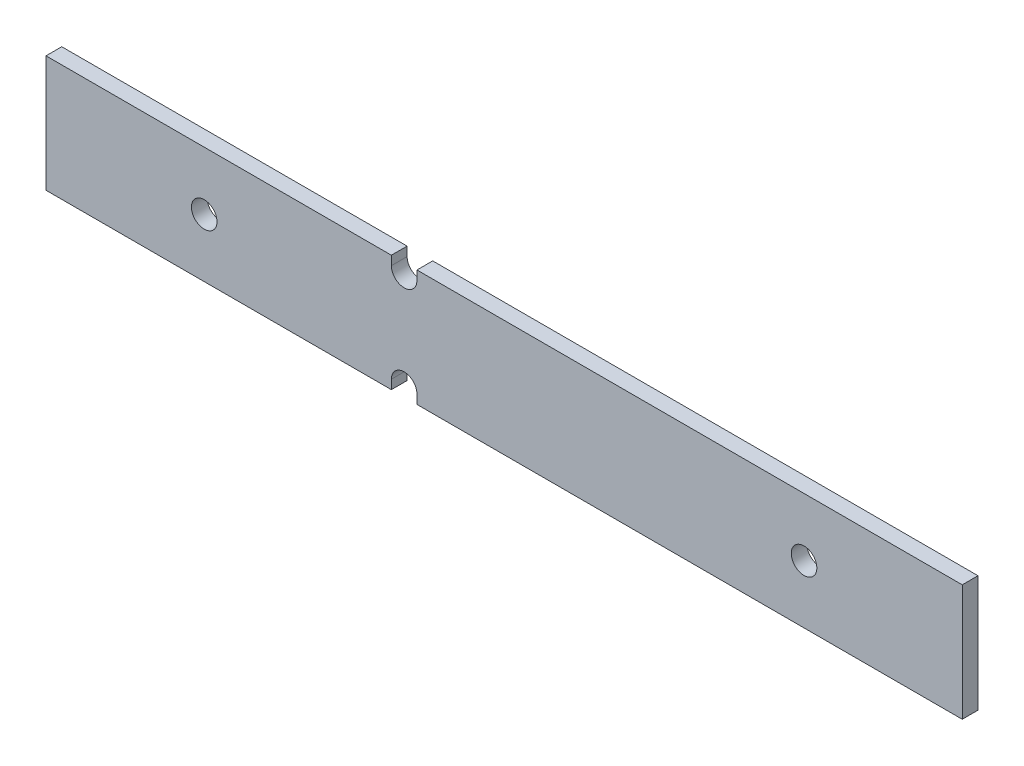
ISO-10303-21;
HEADER;
FILE_DESCRIPTION(('STEP AP214'),'2;1');
FILE_NAME('part.step','',(''),(''),'','','');
FILE_SCHEMA(('AUTOMOTIVE_DESIGN { 1 0 10303 214 1 1 1 1 }'));
ENDSEC;
DATA;
#1=APPLICATION_CONTEXT('core data for automotive mechanical design processes');
#2=APPLICATION_PROTOCOL_DEFINITION('international standard','automotive_design',2000,#1);
#3=PRODUCT_CONTEXT('',#1,'mechanical');
#4=PRODUCT('Part','Part','',(#3));
#5=PRODUCT_RELATED_PRODUCT_CATEGORY('part','',(#4));
#6=PRODUCT_DEFINITION_FORMATION('','',#4);
#7=PRODUCT_DEFINITION_CONTEXT('part definition',#1,'design');
#8=PRODUCT_DEFINITION('design','',#6,#7);
#9=PRODUCT_DEFINITION_SHAPE('','',#8);
#10=(LENGTH_UNIT() NAMED_UNIT(*) SI_UNIT(.MILLI.,.METRE.));
#11=(NAMED_UNIT(*) PLANE_ANGLE_UNIT() SI_UNIT($,.RADIAN.));
#12=(NAMED_UNIT(*) SI_UNIT($,.STERADIAN.) SOLID_ANGLE_UNIT());
#13=UNCERTAINTY_MEASURE_WITH_UNIT(LENGTH_MEASURE(1.E-05),#10,'distance_accuracy_value','');
#14=(GEOMETRIC_REPRESENTATION_CONTEXT(3) GLOBAL_UNCERTAINTY_ASSIGNED_CONTEXT((#13)) GLOBAL_UNIT_ASSIGNED_CONTEXT((#10,
#11,#12)) REPRESENTATION_CONTEXT('',''));
#15=CARTESIAN_POINT('',(0.,0.,0.));
#16=DIRECTION('',(0.,0.,1.));
#17=DIRECTION('',(1.,0.,0.));
#18=AXIS2_PLACEMENT_3D('',#15,#16,#17);
#19=CARTESIAN_POINT('',(-50.8000000637241,-4.99745883228669,3.23019999998743));
#20=DIRECTION('',(0.,0.,1.));
#21=DIRECTION('',(1.,0.,0.));
#22=AXIS2_PLACEMENT_3D('',#19,#20,#21);
#23=CYLINDRICAL_SURFACE('',#22,1.3);
#24=CARTESIAN_POINT('',(-50.8000000637241,-4.99745883228669,3.23019999998743));
#25=DIRECTION('',(0.,0.,1.));
#26=DIRECTION('',(1.,0.,0.));
#27=AXIS2_PLACEMENT_3D('',#24,#25,#26);
#28=CIRCLE('',#27,1.3);
#29=CARTESIAN_POINT('',(-49.5000000637241,-4.99745883228651,3.23019999998743));
#30=VERTEX_POINT('',#29);
#31=CARTESIAN_POINT('',(-52.1000000637241,-4.99745883228699,3.23019999998737));
#32=VERTEX_POINT('',#31);
#33=EDGE_CURVE('E178',#30,#32,#28,.T.);
#34=ORIENTED_EDGE('',*,*,#33,.T.);
#35=DIRECTION('',(0.,0.,1.));
#36=VECTOR('',#35,1.);
#37=CARTESIAN_POINT('',(-52.1000000637241,-4.997458832287,1.6299999999874));
#38=LINE('',#37,#36);
#39=CARTESIAN_POINT('',(-52.1000000637241,-4.997458832287,1.6299999999874));
#40=VERTEX_POINT('',#39);
#41=EDGE_CURVE('E221',#40,#32,#38,.T.);
#42=ORIENTED_EDGE('',*,*,#41,.F.);
#43=CARTESIAN_POINT('',(-50.8000000637241,-4.99745883228669,1.62999999998741));
#44=DIRECTION('',(0.,0.,1.));
#45=DIRECTION('',(1.,0.,0.));
#46=AXIS2_PLACEMENT_3D('',#43,#44,#45);
#47=CIRCLE('',#46,1.3);
#48=CARTESIAN_POINT('',(-49.5000000637241,-4.99745883228652,1.62999999998741));
#49=VERTEX_POINT('',#48);
#50=EDGE_CURVE('E49',#49,#40,#47,.T.);
#51=ORIENTED_EDGE('',*,*,#50,.F.);
#52=DIRECTION('',(0.,0.,1.));
#53=VECTOR('',#52,1.);
#54=CARTESIAN_POINT('',(-49.5000000637241,-4.99745883228652,1.62999999998741));
#55=LINE('',#54,#53);
#56=EDGE_CURVE('E245',#49,#30,#55,.T.);
#57=ORIENTED_EDGE('',*,*,#56,.T.);
#58=EDGE_LOOP('',(#34,#42,#51,#57));
#59=FACE_BOUND('',#58,.T.);
#60=ADVANCED_FACE('F41',(#59),#23,.F.);
#61=CARTESIAN_POINT('',(5.9181999539004,5.91819995396554,3.23019999998763));
#62=DIRECTION('',(0.,-1.,0.));
#63=DIRECTION('',(1.,0.,0.));
#64=AXIS2_PLACEMENT_3D('',#61,#62,#63);
#65=PLANE('',#64);
#66=DIRECTION('',(-1.,0.,0.));
#67=VECTOR('',#66,1.);
#68=CARTESIAN_POINT('',(5.9181999539004,5.91819995396554,1.62999999998762));
#69=LINE('',#68,#67);
#70=CARTESIAN_POINT('',(5.9181999539004,5.91819995396554,1.62999999998762));
#71=VERTEX_POINT('',#70);
#72=CARTESIAN_POINT('',(-49.5000000637242,5.91819995396584,1.62999999998741));
#73=VERTEX_POINT('',#72);
#74=EDGE_CURVE('E263',#71,#73,#69,.T.);
#75=ORIENTED_EDGE('',*,*,#74,.T.);
#76=DIRECTION('',(0.,0.,1.));
#77=VECTOR('',#76,1.);
#78=CARTESIAN_POINT('',(-49.5000000637242,5.91819995396584,1.62999999998741));
#79=LINE('',#78,#77);
#80=CARTESIAN_POINT('',(-49.5000000637242,5.91819995396584,3.23019999998742));
#81=VERTEX_POINT('',#80);
#82=EDGE_CURVE('E230',#73,#81,#79,.T.);
#83=ORIENTED_EDGE('',*,*,#82,.T.);
#84=DIRECTION('',(-1.,0.,0.));
#85=VECTOR('',#84,1.);
#86=CARTESIAN_POINT('',(5.9181999539004,5.91819995396554,3.23019999998763));
#87=LINE('',#86,#85);
#88=CARTESIAN_POINT('',(5.9181999539004,5.91819995396554,3.23019999998763));
#89=VERTEX_POINT('',#88);
#90=EDGE_CURVE('E209',#89,#81,#87,.T.);
#91=ORIENTED_EDGE('',*,*,#90,.F.);
#92=DIRECTION('',(0.,0.,-1.));
#93=VECTOR('',#92,1.);
#94=CARTESIAN_POINT('',(5.9181999539004,5.91819995396554,3.23019999998763));
#95=LINE('',#94,#93);
#96=EDGE_CURVE('E169',#89,#71,#95,.T.);
#97=ORIENTED_EDGE('',*,*,#96,.T.);
#98=EDGE_LOOP('',(#75,#83,#91,#97));
#99=FACE_BOUND('',#98,.T.);
#100=ADVANCED_FACE('F265',(#99),#65,.F.);
#101=CARTESIAN_POINT('',(5.91819995390036,-5.91819995397096,3.23019999998758));
#102=DIRECTION('',(0.,1.,0.));
#103=DIRECTION('',(-1.,0.,0.));
#104=AXIS2_PLACEMENT_3D('',#101,#102,#103);
#105=PLANE('',#104);
#106=DIRECTION('',(1.,0.,0.));
#107=VECTOR('',#106,1.);
#108=CARTESIAN_POINT('',(5.91819995390036,-5.91819995397096,1.62999999998764));
#109=LINE('',#108,#107);
#110=CARTESIAN_POINT('',(-87.1981999509101,-5.91819995397121,1.62999999998727));
#111=VERTEX_POINT('',#110);
#112=CARTESIAN_POINT('',(-52.1000000637242,-5.91819995397121,1.6299999999874));
#113=VERTEX_POINT('',#112);
#114=EDGE_CURVE('E144',#111,#113,#109,.T.);
#115=ORIENTED_EDGE('',*,*,#114,.T.);
#116=DIRECTION('',(0.,0.,1.));
#117=VECTOR('',#116,1.);
#118=CARTESIAN_POINT('',(-52.1000000637242,-5.91819995397121,1.6299999999874));
#119=LINE('',#118,#117);
#120=CARTESIAN_POINT('',(-52.1000000637242,-5.91819995397121,3.23019999998743));
#121=VERTEX_POINT('',#120);
#122=EDGE_CURVE('E128',#113,#121,#119,.T.);
#123=ORIENTED_EDGE('',*,*,#122,.T.);
#124=DIRECTION('',(1.,0.,0.));
#125=VECTOR('',#124,1.);
#126=CARTESIAN_POINT('',(5.91819995390036,-5.91819995397096,3.23019999998758));
#127=LINE('',#126,#125);
#128=CARTESIAN_POINT('',(-87.1981999509101,-5.91819995397121,3.23019999998725));
#129=VERTEX_POINT('',#128);
#130=EDGE_CURVE('E165',#129,#121,#127,.T.);
#131=ORIENTED_EDGE('',*,*,#130,.F.);
#132=DIRECTION('',(0.,0.,-1.));
#133=VECTOR('',#132,1.);
#134=CARTESIAN_POINT('',(-87.1981999509101,-5.91819995397121,3.23019999998725));
#135=LINE('',#134,#133);
#136=EDGE_CURVE('E151',#129,#111,#135,.T.);
#137=ORIENTED_EDGE('',*,*,#136,.T.);
#138=EDGE_LOOP('',(#115,#123,#131,#137));
#139=FACE_BOUND('',#138,.T.);
#140=ADVANCED_FACE('F149',(#139),#105,.F.);
#141=CARTESIAN_POINT('',(5.91819995390036,-5.91819995397096,3.23019999998758));
#142=DIRECTION('',(-1.,0.,0.));
#143=DIRECTION('',(0.,0.,1.));
#144=AXIS2_PLACEMENT_3D('',#141,#142,#143);
#145=PLANE('',#144);
#146=DIRECTION('',(0.,1.,0.));
#147=VECTOR('',#146,1.);
#148=CARTESIAN_POINT('',(5.91819995390036,-5.91819995397096,1.62999999998764));
#149=LINE('',#148,#147);
#150=CARTESIAN_POINT('',(5.91819995390036,-5.91819995397096,1.62999999998764));
#151=VERTEX_POINT('',#150);
#152=EDGE_CURVE('E197',#151,#71,#149,.T.);
#153=ORIENTED_EDGE('',*,*,#152,.T.);
#154=ORIENTED_EDGE('',*,*,#96,.F.);
#155=DIRECTION('',(0.,1.,0.));
#156=VECTOR('',#155,1.);
#157=CARTESIAN_POINT('',(5.91819995390036,-5.91819995397096,3.23019999998758));
#158=LINE('',#157,#156);
#159=CARTESIAN_POINT('',(5.91819995390036,-5.91819995397096,3.23019999998758));
#160=VERTEX_POINT('',#159);
#161=EDGE_CURVE('E152',#160,#89,#158,.T.);
#162=ORIENTED_EDGE('',*,*,#161,.F.);
#163=DIRECTION('',(0.,0.,-1.));
#164=VECTOR('',#163,1.);
#165=CARTESIAN_POINT('',(5.91819995390036,-5.91819995397096,3.23019999998758));
#166=LINE('',#165,#164);
#167=EDGE_CURVE('E162',#160,#151,#166,.T.);
#168=ORIENTED_EDGE('',*,*,#167,.T.);
#169=EDGE_LOOP('',(#153,#154,#162,#168));
#170=FACE_BOUND('',#169,.T.);
#171=ADVANCED_FACE('F43',(#170),#145,.F.);
#172=CARTESIAN_POINT('',(-52.1000000637242,5.91819995396554,3.23019999998742));
#173=VERTEX_POINT('',#172);
#174=CARTESIAN_POINT('',(-87.1981999509101,5.91819995396554,3.2301999999873));
#175=VERTEX_POINT('',#174);
#176=EDGE_CURVE('E156',#173,#175,#87,.T.);
#177=ORIENTED_EDGE('',*,*,#176,.F.);
#178=DIRECTION('',(0.,0.,1.));
#179=VECTOR('',#178,1.);
#180=CARTESIAN_POINT('',(-52.1000000637242,5.91819995396554,1.62999999998739));
#181=LINE('',#180,#179);
#182=CARTESIAN_POINT('',(-52.1000000637242,5.91819995396554,1.62999999998739));
#183=VERTEX_POINT('',#182);
#184=EDGE_CURVE('E227',#183,#173,#181,.T.);
#185=ORIENTED_EDGE('',*,*,#184,.F.);
#186=CARTESIAN_POINT('',(-87.1981999509101,5.91819995396553,1.62999999998726));
#187=VERTEX_POINT('',#186);
#188=EDGE_CURVE('E266',#183,#187,#69,.T.);
#189=ORIENTED_EDGE('',*,*,#188,.T.);
#190=DIRECTION('',(0.,0.,-1.));
#191=VECTOR('',#190,1.);
#192=CARTESIAN_POINT('',(-87.1981999509101,5.91819995396554,3.2301999999873));
#193=LINE('',#192,#191);
#194=EDGE_CURVE('E167',#175,#187,#193,.T.);
#195=ORIENTED_EDGE('',*,*,#194,.F.);
#196=EDGE_LOOP('',(#177,#185,#189,#195));
#197=FACE_BOUND('',#196,.T.);
#198=ADVANCED_FACE('F308',(#197),#65,.F.);
#199=CARTESIAN_POINT('',(-87.1981999509101,-5.91819995397121,3.23019999998725));
#200=DIRECTION('',(1.,0.,0.));
#201=DIRECTION('',(0.,0.,-1.));
#202=AXIS2_PLACEMENT_3D('',#199,#200,#201);
#203=PLANE('',#202);
#204=DIRECTION('',(0.,-1.,0.));
#205=VECTOR('',#204,1.);
#206=CARTESIAN_POINT('',(-87.1981999509101,-5.91819995397121,1.62999999998727));
#207=LINE('',#206,#205);
#208=EDGE_CURVE('E158',#187,#111,#207,.T.);
#209=ORIENTED_EDGE('',*,*,#208,.T.);
#210=ORIENTED_EDGE('',*,*,#136,.F.);
#211=DIRECTION('',(0.,-1.,0.));
#212=VECTOR('',#211,1.);
#213=CARTESIAN_POINT('',(-87.1981999509101,-5.91819995397121,3.23019999998725));
#214=LINE('',#213,#212);
#215=EDGE_CURVE('E194',#175,#129,#214,.T.);
#216=ORIENTED_EDGE('',*,*,#215,.F.);
#217=ORIENTED_EDGE('',*,*,#194,.T.);
#218=EDGE_LOOP('',(#209,#210,#216,#217));
#219=FACE_BOUND('',#218,.T.);
#220=ADVANCED_FACE('F299',(#219),#203,.F.);
#221=CARTESIAN_POINT('',(-49.5000000637242,-5.91819995397073,3.23019999998743));
#222=VERTEX_POINT('',#221);
#223=EDGE_CURVE('E193',#222,#160,#127,.T.);
#224=ORIENTED_EDGE('',*,*,#223,.F.);
#225=DIRECTION('',(0.,0.,1.));
#226=VECTOR('',#225,1.);
#227=CARTESIAN_POINT('',(-49.5000000637242,-5.91819995397073,1.62999999998741));
#228=LINE('',#227,#226);
#229=CARTESIAN_POINT('',(-49.5000000637242,-5.91819995397073,1.62999999998741));
#230=VERTEX_POINT('',#229);
#231=EDGE_CURVE('E136',#230,#222,#228,.T.);
#232=ORIENTED_EDGE('',*,*,#231,.F.);
#233=EDGE_CURVE('E153',#230,#151,#109,.T.);
#234=ORIENTED_EDGE('',*,*,#233,.T.);
#235=ORIENTED_EDGE('',*,*,#167,.F.);
#236=EDGE_LOOP('',(#224,#232,#234,#235));
#237=FACE_BOUND('',#236,.T.);
#238=ADVANCED_FACE('F292',(#237),#105,.F.);
#239=CARTESIAN_POINT('',(0.,0.,3.23019999998759));
#240=DIRECTION('',(0.,0.,1.));
#241=DIRECTION('',(1.,0.,0.));
#242=AXIS2_PLACEMENT_3D('',#239,#240,#241);
#243=PLANE('',#242);
#244=DIRECTION('',(0.,-1.,0.));
#245=VECTOR('',#244,1.);
#246=CARTESIAN_POINT('',(-52.1000000637241,-4.99745883228699,3.23019999998737));
#247=LINE('',#246,#245);
#248=EDGE_CURVE('E131',#32,#121,#247,.T.);
#249=ORIENTED_EDGE('',*,*,#248,.F.);
#250=ORIENTED_EDGE('',*,*,#33,.F.);
#251=DIRECTION('',(0.,1.,0.));
#252=VECTOR('',#251,1.);
#253=CARTESIAN_POINT('',(-49.5000000637241,-4.99745883228652,3.23019999998743));
#254=LINE('',#253,#252);
#255=EDGE_CURVE('E56',#222,#30,#254,.T.);
#256=ORIENTED_EDGE('',*,*,#255,.F.);
#257=ORIENTED_EDGE('',*,*,#223,.T.);
#258=ORIENTED_EDGE('',*,*,#161,.T.);
#259=ORIENTED_EDGE('',*,*,#90,.T.);
#260=DIRECTION('',(0.,1.,0.));
#261=VECTOR('',#260,1.);
#262=CARTESIAN_POINT('',(-49.5000000637243,4.99745883228729,3.23019999998742));
#263=LINE('',#262,#261);
#264=CARTESIAN_POINT('',(-49.5000000637243,4.99745883228729,3.23019999998742));
#265=VERTEX_POINT('',#264);
#266=EDGE_CURVE('E220',#265,#81,#263,.T.);
#267=ORIENTED_EDGE('',*,*,#266,.F.);
#268=CARTESIAN_POINT('',(-50.8000000637243,4.9974588322873,3.23019999998742));
#269=DIRECTION('',(0.,0.,1.));
#270=DIRECTION('',(1.,0.,0.));
#271=AXIS2_PLACEMENT_3D('',#268,#269,#270);
#272=CIRCLE('',#271,1.3);
#273=CARTESIAN_POINT('',(-52.1000000637243,4.99745883228701,3.2301999999874));
#274=VERTEX_POINT('',#273);
#275=EDGE_CURVE('E229',#274,#265,#272,.T.);
#276=ORIENTED_EDGE('',*,*,#275,.F.);
#277=DIRECTION('',(0.,-1.,0.));
#278=VECTOR('',#277,1.);
#279=CARTESIAN_POINT('',(-52.1000000637243,4.99745883228701,3.2301999999874));
#280=LINE('',#279,#278);
#281=EDGE_CURVE('E216',#173,#274,#280,.T.);
#282=ORIENTED_EDGE('',*,*,#281,.F.);
#283=ORIENTED_EDGE('',*,*,#176,.T.);
#284=ORIENTED_EDGE('',*,*,#215,.T.);
#285=ORIENTED_EDGE('',*,*,#130,.T.);
#286=EDGE_LOOP('',(#249,#250,#256,#257,#258,#259,#267,#276,#282,#283,#284,#285));
#287=FACE_BOUND('',#286,.T.);
#288=CARTESIAN_POINT('',(-10.1600000918156,-7.5986245073878E-08,3.23019999998755));
#289=DIRECTION('',(0.,0.,1.));
#290=DIRECTION('',(1.,0.,0.));
#291=AXIS2_PLACEMENT_3D('',#288,#289,#290);
#292=CIRCLE('',#291,1.3);
#293=CARTESIAN_POINT('',(-8.86000009181561,-7.5986245073878E-08,3.23019999998756));
#294=VERTEX_POINT('',#293);
#295=EDGE_CURVE('E181',#294,#294,#292,.T.);
#296=ORIENTED_EDGE('',*,*,#295,.F.);
#297=EDGE_LOOP('',(#296));
#298=FACE_BOUND('',#297,.T.);
#299=CARTESIAN_POINT('',(-71.1199998115936,-3.45395240186619E-08,3.23019999998734));
#300=DIRECTION('',(0.,0.,1.));
#301=DIRECTION('',(1.,0.,0.));
#302=AXIS2_PLACEMENT_3D('',#299,#300,#301);
#303=CIRCLE('',#302,1.3);
#304=CARTESIAN_POINT('',(-69.8199998115936,-3.45395240186619E-08,3.23019999998734));
#305=VERTEX_POINT('',#304);
#306=EDGE_CURVE('E272',#305,#305,#303,.T.);
#307=ORIENTED_EDGE('',*,*,#306,.F.);
#308=EDGE_LOOP('',(#307));
#309=FACE_BOUND('',#308,.T.);
#310=ADVANCED_FACE('F247',(#287,#298,#309),#243,.T.);
#311=CARTESIAN_POINT('',(0.,0.,1.6299999999876));
#312=DIRECTION('',(0.,0.,1.));
#313=DIRECTION('',(1.,0.,0.));
#314=AXIS2_PLACEMENT_3D('',#311,#312,#313);
#315=PLANE('',#314);
#316=CARTESIAN_POINT('',(-10.1600000918156,-7.5986245073878E-08,1.62999999998758));
#317=DIRECTION('',(0.,0.,1.));
#318=DIRECTION('',(1.,0.,0.));
#319=AXIS2_PLACEMENT_3D('',#316,#317,#318);
#320=CIRCLE('',#319,1.3);
#321=CARTESIAN_POINT('',(-8.86000009181561,-7.5986245073878E-08,1.62999999998758));
#322=VERTEX_POINT('',#321);
#323=EDGE_CURVE('E185',#322,#322,#320,.T.);
#324=ORIENTED_EDGE('',*,*,#323,.T.);
#325=EDGE_LOOP('',(#324));
#326=FACE_BOUND('',#325,.T.);
#327=CARTESIAN_POINT('',(-71.1199998115936,-3.45395240186619E-08,1.62999999998735));
#328=DIRECTION('',(0.,0.,1.));
#329=DIRECTION('',(1.,0.,0.));
#330=AXIS2_PLACEMENT_3D('',#327,#328,#329);
#331=CIRCLE('',#330,1.3);
#332=CARTESIAN_POINT('',(-69.8199998115936,-3.45395240186619E-08,1.62999999998735));
#333=VERTEX_POINT('',#332);
#334=EDGE_CURVE('E208',#333,#333,#331,.T.);
#335=ORIENTED_EDGE('',*,*,#334,.T.);
#336=EDGE_LOOP('',(#335));
#337=FACE_BOUND('',#336,.T.);
#338=ORIENTED_EDGE('',*,*,#50,.T.);
#339=DIRECTION('',(0.,-1.,0.));
#340=VECTOR('',#339,1.);
#341=CARTESIAN_POINT('',(-52.1000000637241,-4.997458832287,1.6299999999874));
#342=LINE('',#341,#340);
#343=EDGE_CURVE('E64',#40,#113,#342,.T.);
#344=ORIENTED_EDGE('',*,*,#343,.T.);
#345=ORIENTED_EDGE('',*,*,#114,.F.);
#346=ORIENTED_EDGE('',*,*,#208,.F.);
#347=ORIENTED_EDGE('',*,*,#188,.F.);
#348=DIRECTION('',(0.,-1.,0.));
#349=VECTOR('',#348,1.);
#350=CARTESIAN_POINT('',(-52.1000000637243,4.997458832287,1.62999999998741));
#351=LINE('',#350,#349);
#352=CARTESIAN_POINT('',(-52.1000000637243,4.997458832287,1.62999999998741));
#353=VERTEX_POINT('',#352);
#354=EDGE_CURVE('E226',#183,#353,#351,.T.);
#355=ORIENTED_EDGE('',*,*,#354,.T.);
#356=CARTESIAN_POINT('',(-50.8000000637243,4.9974588322873,1.62999999998741));
#357=DIRECTION('',(0.,0.,1.));
#358=DIRECTION('',(1.,0.,0.));
#359=AXIS2_PLACEMENT_3D('',#356,#357,#358);
#360=CIRCLE('',#359,1.3);
#361=CARTESIAN_POINT('',(-49.5000000637243,4.99745883228729,1.62999999998741));
#362=VERTEX_POINT('',#361);
#363=EDGE_CURVE('E12',#353,#362,#360,.T.);
#364=ORIENTED_EDGE('',*,*,#363,.T.);
#365=DIRECTION('',(0.,1.,0.));
#366=VECTOR('',#365,1.);
#367=CARTESIAN_POINT('',(-49.5000000637243,4.99745883228729,1.62999999998741));
#368=LINE('',#367,#366);
#369=EDGE_CURVE('E222',#362,#73,#368,.T.);
#370=ORIENTED_EDGE('',*,*,#369,.T.);
#371=ORIENTED_EDGE('',*,*,#74,.F.);
#372=ORIENTED_EDGE('',*,*,#152,.F.);
#373=ORIENTED_EDGE('',*,*,#233,.F.);
#374=DIRECTION('',(0.,1.,0.));
#375=VECTOR('',#374,1.);
#376=CARTESIAN_POINT('',(-49.5000000637241,-4.99745883228652,1.62999999998741));
#377=LINE('',#376,#375);
#378=EDGE_CURVE('E137',#230,#49,#377,.T.);
#379=ORIENTED_EDGE('',*,*,#378,.T.);
#380=EDGE_LOOP('',(#338,#344,#345,#346,#347,#355,#364,#370,#371,#372,#373,#379));
#381=FACE_BOUND('',#380,.T.);
#382=ADVANCED_FACE('F142',(#326,#337,#381),#315,.F.);
#383=CARTESIAN_POINT('',(-71.1199998115936,-3.45395240186619E-08,3.23019999998734));
#384=DIRECTION('',(0.,0.,1.));
#385=DIRECTION('',(1.,0.,0.));
#386=AXIS2_PLACEMENT_3D('',#383,#384,#385);
#387=CYLINDRICAL_SURFACE('',#386,1.3);
#388=ORIENTED_EDGE('',*,*,#334,.F.);
#389=EDGE_LOOP('',(#388));
#390=FACE_BOUND('',#389,.T.);
#391=ORIENTED_EDGE('',*,*,#306,.T.);
#392=EDGE_LOOP('',(#391));
#393=FACE_BOUND('',#392,.T.);
#394=ADVANCED_FACE('F287',(#390,#393),#387,.F.);
#395=CARTESIAN_POINT('',(-10.1600000918156,-7.5986245073878E-08,3.23019999998755));
#396=DIRECTION('',(0.,0.,1.));
#397=DIRECTION('',(1.,0.,0.));
#398=AXIS2_PLACEMENT_3D('',#395,#396,#397);
#399=CYLINDRICAL_SURFACE('',#398,1.3);
#400=ORIENTED_EDGE('',*,*,#323,.F.);
#401=EDGE_LOOP('',(#400));
#402=FACE_BOUND('',#401,.T.);
#403=ORIENTED_EDGE('',*,*,#295,.T.);
#404=EDGE_LOOP('',(#403));
#405=FACE_BOUND('',#404,.T.);
#406=ADVANCED_FACE('F283',(#402,#405),#399,.F.);
#407=CARTESIAN_POINT('',(-50.8000000637243,4.9974588322873,3.23019999998742));
#408=DIRECTION('',(0.,0.,1.));
#409=DIRECTION('',(1.,0.,0.));
#410=AXIS2_PLACEMENT_3D('',#407,#408,#409);
#411=CYLINDRICAL_SURFACE('',#410,1.3);
#412=ORIENTED_EDGE('',*,*,#275,.T.);
#413=DIRECTION('',(0.,0.,1.));
#414=VECTOR('',#413,1.);
#415=CARTESIAN_POINT('',(-49.5000000637243,4.99745883228729,1.62999999998741));
#416=LINE('',#415,#414);
#417=EDGE_CURVE('E233',#362,#265,#416,.T.);
#418=ORIENTED_EDGE('',*,*,#417,.F.);
#419=ORIENTED_EDGE('',*,*,#363,.F.);
#420=DIRECTION('',(0.,0.,1.));
#421=VECTOR('',#420,1.);
#422=CARTESIAN_POINT('',(-52.1000000637243,4.997458832287,1.62999999998741));
#423=LINE('',#422,#421);
#424=EDGE_CURVE('E235',#353,#274,#423,.T.);
#425=ORIENTED_EDGE('',*,*,#424,.T.);
#426=EDGE_LOOP('',(#412,#418,#419,#425));
#427=FACE_BOUND('',#426,.T.);
#428=ADVANCED_FACE('F286',(#427),#411,.F.);
#429=CARTESIAN_POINT('',(-52.1000000637243,4.997458832287,1.62999999998741));
#430=DIRECTION('',(-1.,0.,0.));
#431=DIRECTION('',(0.,0.,1.));
#432=AXIS2_PLACEMENT_3D('',#429,#430,#431);
#433=PLANE('',#432);
#434=ORIENTED_EDGE('',*,*,#281,.T.);
#435=ORIENTED_EDGE('',*,*,#424,.F.);
#436=ORIENTED_EDGE('',*,*,#354,.F.);
#437=ORIENTED_EDGE('',*,*,#184,.T.);
#438=EDGE_LOOP('',(#434,#435,#436,#437));
#439=FACE_BOUND('',#438,.T.);
#440=ADVANCED_FACE('F327',(#439),#433,.F.);
#441=CARTESIAN_POINT('',(-49.5000000637243,4.99745883228729,1.62999999998741));
#442=DIRECTION('',(1.,0.,0.));
#443=DIRECTION('',(0.,0.,-1.));
#444=AXIS2_PLACEMENT_3D('',#441,#442,#443);
#445=PLANE('',#444);
#446=ORIENTED_EDGE('',*,*,#266,.T.);
#447=ORIENTED_EDGE('',*,*,#82,.F.);
#448=ORIENTED_EDGE('',*,*,#369,.F.);
#449=ORIENTED_EDGE('',*,*,#417,.T.);
#450=EDGE_LOOP('',(#446,#447,#448,#449));
#451=FACE_BOUND('',#450,.T.);
#452=ADVANCED_FACE('F333',(#451),#445,.F.);
#453=CARTESIAN_POINT('',(-49.5000000637241,-4.99745883228652,1.62999999998741));
#454=DIRECTION('',(1.,0.,0.));
#455=DIRECTION('',(0.,0.,-1.));
#456=AXIS2_PLACEMENT_3D('',#453,#454,#455);
#457=PLANE('',#456);
#458=ORIENTED_EDGE('',*,*,#255,.T.);
#459=ORIENTED_EDGE('',*,*,#56,.F.);
#460=ORIENTED_EDGE('',*,*,#378,.F.);
#461=ORIENTED_EDGE('',*,*,#231,.T.);
#462=EDGE_LOOP('',(#458,#459,#460,#461));
#463=FACE_BOUND('',#462,.T.);
#464=ADVANCED_FACE('F340',(#463),#457,.F.);
#465=CARTESIAN_POINT('',(-52.1000000637241,-4.997458832287,1.6299999999874));
#466=DIRECTION('',(-1.,0.,0.));
#467=DIRECTION('',(0.,0.,1.));
#468=AXIS2_PLACEMENT_3D('',#465,#466,#467);
#469=PLANE('',#468);
#470=ORIENTED_EDGE('',*,*,#248,.T.);
#471=ORIENTED_EDGE('',*,*,#122,.F.);
#472=ORIENTED_EDGE('',*,*,#343,.F.);
#473=ORIENTED_EDGE('',*,*,#41,.T.);
#474=EDGE_LOOP('',(#470,#471,#472,#473));
#475=FACE_BOUND('',#474,.T.);
#476=ADVANCED_FACE('F129',(#475),#469,.F.);
#477=CLOSED_SHELL('',(#60,#100,#140,#171,#198,#220,#238,#310,#382,#394,#406,#428,#440,#452,#464,#476));
#478=MANIFOLD_SOLID_BREP('B2',#477);
#479=ADVANCED_BREP_SHAPE_REPRESENTATION('',(#18,#478),#14);
#480=SHAPE_DEFINITION_REPRESENTATION(#9,#479);
ENDSEC;
END-ISO-10303-21;
